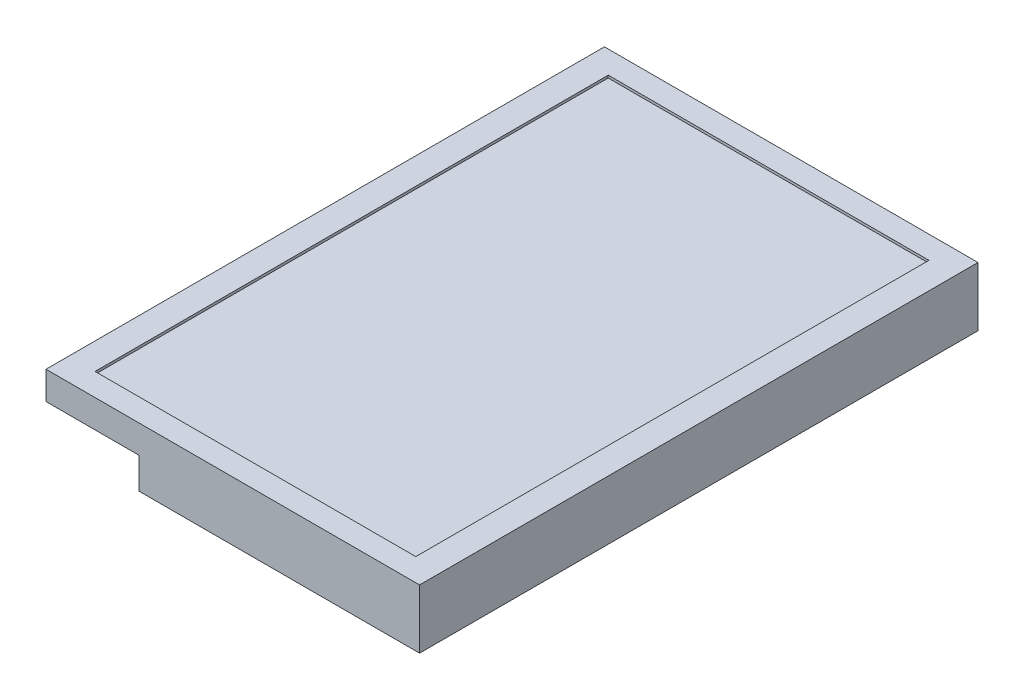
ISO-10303-21;
HEADER;
FILE_DESCRIPTION(('STEP AP214'),'2;1');
FILE_NAME('part.step','',(''),(''),'','','');
FILE_SCHEMA(('AUTOMOTIVE_DESIGN { 1 0 10303 214 1 1 1 1 }'));
ENDSEC;
DATA;
#1=APPLICATION_CONTEXT('core data for automotive mechanical design processes');
#2=APPLICATION_PROTOCOL_DEFINITION('international standard','automotive_design',2000,#1);
#3=PRODUCT_CONTEXT('',#1,'mechanical');
#4=PRODUCT('Part','Part','',(#3));
#5=PRODUCT_RELATED_PRODUCT_CATEGORY('part','',(#4));
#6=PRODUCT_DEFINITION_FORMATION('','',#4);
#7=PRODUCT_DEFINITION_CONTEXT('part definition',#1,'design');
#8=PRODUCT_DEFINITION('design','',#6,#7);
#9=PRODUCT_DEFINITION_SHAPE('','',#8);
#10=(LENGTH_UNIT() NAMED_UNIT(*) SI_UNIT(.MILLI.,.METRE.));
#11=(NAMED_UNIT(*) PLANE_ANGLE_UNIT() SI_UNIT($,.RADIAN.));
#12=(NAMED_UNIT(*) SI_UNIT($,.STERADIAN.) SOLID_ANGLE_UNIT());
#13=UNCERTAINTY_MEASURE_WITH_UNIT(LENGTH_MEASURE(1.E-05),#10,'distance_accuracy_value','');
#14=(GEOMETRIC_REPRESENTATION_CONTEXT(3) GLOBAL_UNCERTAINTY_ASSIGNED_CONTEXT((#13)) GLOBAL_UNIT_ASSIGNED_CONTEXT((#10,
#11,#12)) REPRESENTATION_CONTEXT('',''));
#15=CARTESIAN_POINT('',(0.,0.,0.));
#16=DIRECTION('',(0.,0.,1.));
#17=DIRECTION('',(1.,0.,0.));
#18=AXIS2_PLACEMENT_3D('',#15,#16,#17);
#19=CARTESIAN_POINT('',(-148.5,47.,222.));
#20=DIRECTION('',(1.,0.,0.));
#21=DIRECTION('',(0.,0.,-1.));
#22=AXIS2_PLACEMENT_3D('',#19,#20,#21);
#23=PLANE('',#22);
#24=DIRECTION('',(0.,0.,-1.));
#25=VECTOR('',#24,1.);
#26=CARTESIAN_POINT('',(-148.5,24.7368421052632,222.));
#27=LINE('',#26,#25);
#28=CARTESIAN_POINT('',(-148.5,24.7368421052632,222.));
#29=VERTEX_POINT('',#28);
#30=CARTESIAN_POINT('',(-148.5,24.7368421052632,-222.));
#31=VERTEX_POINT('',#30);
#32=EDGE_CURVE('E109',#29,#31,#27,.T.);
#33=ORIENTED_EDGE('',*,*,#32,.F.);
#34=DIRECTION('',(0.,-1.,0.));
#35=VECTOR('',#34,1.);
#36=CARTESIAN_POINT('',(-148.5,47.,222.));
#37=LINE('',#36,#35);
#38=CARTESIAN_POINT('',(-148.5,47.,222.));
#39=VERTEX_POINT('',#38);
#40=EDGE_CURVE('E130',#39,#29,#37,.T.);
#41=ORIENTED_EDGE('',*,*,#40,.F.);
#42=DIRECTION('',(0.,0.,1.));
#43=VECTOR('',#42,1.);
#44=CARTESIAN_POINT('',(-148.5,47.,222.));
#45=LINE('',#44,#43);
#46=CARTESIAN_POINT('',(-148.5,47.,-222.));
#47=VERTEX_POINT('',#46);
#48=EDGE_CURVE('E129',#47,#39,#45,.T.);
#49=ORIENTED_EDGE('',*,*,#48,.F.);
#50=DIRECTION('',(0.,-1.,0.));
#51=VECTOR('',#50,1.);
#52=CARTESIAN_POINT('',(-148.5,47.,-222.));
#53=LINE('',#52,#51);
#54=EDGE_CURVE('E40',#47,#31,#53,.T.);
#55=ORIENTED_EDGE('',*,*,#54,.T.);
#56=EDGE_LOOP('',(#33,#41,#49,#55));
#57=FACE_BOUND('',#56,.T.);
#58=ADVANCED_FACE('F32',(#57),#23,.F.);
#59=CARTESIAN_POINT('',(148.5,47.,222.));
#60=DIRECTION('',(-1.,0.,0.));
#61=DIRECTION('',(0.,0.,1.));
#62=AXIS2_PLACEMENT_3D('',#59,#60,#61);
#63=PLANE('',#62);
#64=DIRECTION('',(0.,0.,-1.));
#65=VECTOR('',#64,1.);
#66=CARTESIAN_POINT('',(148.5,0.,222.));
#67=LINE('',#66,#65);
#68=CARTESIAN_POINT('',(148.5,0.,222.));
#69=VERTEX_POINT('',#68);
#70=CARTESIAN_POINT('',(148.5,0.,-222.));
#71=VERTEX_POINT('',#70);
#72=EDGE_CURVE('E142',#69,#71,#67,.T.);
#73=ORIENTED_EDGE('',*,*,#72,.T.);
#74=DIRECTION('',(0.,-1.,0.));
#75=VECTOR('',#74,1.);
#76=CARTESIAN_POINT('',(148.5,47.,-222.));
#77=LINE('',#76,#75);
#78=CARTESIAN_POINT('',(148.5,47.,-222.));
#79=VERTEX_POINT('',#78);
#80=EDGE_CURVE('E11',#79,#71,#77,.T.);
#81=ORIENTED_EDGE('',*,*,#80,.F.);
#82=DIRECTION('',(0.,0.,-1.));
#83=VECTOR('',#82,1.);
#84=CARTESIAN_POINT('',(148.5,47.,222.));
#85=LINE('',#84,#83);
#86=CARTESIAN_POINT('',(148.5,47.,222.));
#87=VERTEX_POINT('',#86);
#88=EDGE_CURVE('E139',#87,#79,#85,.T.);
#89=ORIENTED_EDGE('',*,*,#88,.F.);
#90=DIRECTION('',(0.,-1.,0.));
#91=VECTOR('',#90,1.);
#92=CARTESIAN_POINT('',(148.5,47.,222.));
#93=LINE('',#92,#91);
#94=EDGE_CURVE('E131',#87,#69,#93,.T.);
#95=ORIENTED_EDGE('',*,*,#94,.T.);
#96=EDGE_LOOP('',(#73,#81,#89,#95));
#97=FACE_BOUND('',#96,.T.);
#98=ADVANCED_FACE('F34',(#97),#63,.F.);
#99=CARTESIAN_POINT('',(-148.5,47.,-222.));
#100=DIRECTION('',(0.,0.,1.));
#101=DIRECTION('',(1.,0.,0.));
#102=AXIS2_PLACEMENT_3D('',#99,#100,#101);
#103=PLANE('',#102);
#104=DIRECTION('',(-1.,0.,0.));
#105=VECTOR('',#104,1.);
#106=CARTESIAN_POINT('',(-148.5,0.,-222.));
#107=LINE('',#106,#105);
#108=CARTESIAN_POINT('',(-74.4999999999999,0.,-222.));
#109=VERTEX_POINT('',#108);
#110=EDGE_CURVE('E140',#71,#109,#107,.T.);
#111=ORIENTED_EDGE('',*,*,#110,.T.);
#112=DIRECTION('',(0.,-1.,0.));
#113=VECTOR('',#112,1.);
#114=CARTESIAN_POINT('',(-74.4999999999999,24.7368421052632,-222.));
#115=LINE('',#114,#113);
#116=CARTESIAN_POINT('',(-74.4999999999999,24.7368421052632,-222.));
#117=VERTEX_POINT('',#116);
#118=EDGE_CURVE('E47',#117,#109,#115,.T.);
#119=ORIENTED_EDGE('',*,*,#118,.F.);
#120=DIRECTION('',(1.,0.,0.));
#121=VECTOR('',#120,1.);
#122=CARTESIAN_POINT('',(-148.5,24.7368421052632,-222.));
#123=LINE('',#122,#121);
#124=EDGE_CURVE('E113',#31,#117,#123,.T.);
#125=ORIENTED_EDGE('',*,*,#124,.F.);
#126=ORIENTED_EDGE('',*,*,#54,.F.);
#127=DIRECTION('',(-1.,0.,0.));
#128=VECTOR('',#127,1.);
#129=CARTESIAN_POINT('',(-148.5,47.,-222.));
#130=LINE('',#129,#128);
#131=EDGE_CURVE('E148',#79,#47,#130,.T.);
#132=ORIENTED_EDGE('',*,*,#131,.F.);
#133=ORIENTED_EDGE('',*,*,#80,.T.);
#134=EDGE_LOOP('',(#111,#119,#125,#126,#132,#133));
#135=FACE_BOUND('',#134,.T.);
#136=ADVANCED_FACE('F125',(#135),#103,.F.);
#137=CARTESIAN_POINT('',(-148.5,47.,222.));
#138=DIRECTION('',(0.,0.,-1.));
#139=DIRECTION('',(-1.,0.,0.));
#140=AXIS2_PLACEMENT_3D('',#137,#138,#139);
#141=PLANE('',#140);
#142=DIRECTION('',(-1.,0.,0.));
#143=VECTOR('',#142,1.);
#144=CARTESIAN_POINT('',(-148.5,24.7368421052632,222.));
#145=LINE('',#144,#143);
#146=CARTESIAN_POINT('',(-74.5,24.7368421052632,222.));
#147=VERTEX_POINT('',#146);
#148=EDGE_CURVE('E115',#147,#29,#145,.T.);
#149=ORIENTED_EDGE('',*,*,#148,.F.);
#150=DIRECTION('',(0.,-1.,0.));
#151=VECTOR('',#150,1.);
#152=CARTESIAN_POINT('',(-74.5,24.7368421052632,222.));
#153=LINE('',#152,#151);
#154=CARTESIAN_POINT('',(-74.5,0.,222.));
#155=VERTEX_POINT('',#154);
#156=EDGE_CURVE('E171',#147,#155,#153,.T.);
#157=ORIENTED_EDGE('',*,*,#156,.T.);
#158=DIRECTION('',(1.,0.,0.));
#159=VECTOR('',#158,1.);
#160=CARTESIAN_POINT('',(-148.5,0.,222.));
#161=LINE('',#160,#159);
#162=EDGE_CURVE('E137',#155,#69,#161,.T.);
#163=ORIENTED_EDGE('',*,*,#162,.T.);
#164=ORIENTED_EDGE('',*,*,#94,.F.);
#165=DIRECTION('',(1.,0.,0.));
#166=VECTOR('',#165,1.);
#167=CARTESIAN_POINT('',(-148.5,47.,222.));
#168=LINE('',#167,#166);
#169=EDGE_CURVE('E136',#39,#87,#168,.T.);
#170=ORIENTED_EDGE('',*,*,#169,.F.);
#171=ORIENTED_EDGE('',*,*,#40,.T.);
#172=EDGE_LOOP('',(#149,#157,#163,#164,#170,#171));
#173=FACE_BOUND('',#172,.T.);
#174=ADVANCED_FACE('F188',(#173),#141,.F.);
#175=CARTESIAN_POINT('',(148.5,47.,-222.));
#176=DIRECTION('',(0.,-1.,0.));
#177=DIRECTION('',(0.,0.,-1.));
#178=AXIS2_PLACEMENT_3D('',#175,#176,#177);
#179=PLANE('',#178);
#180=DIRECTION('',(-1.,0.,0.));
#181=VECTOR('',#180,1.);
#182=CARTESIAN_POINT('',(-127.5,47.,-204.));
#183=LINE('',#182,#181);
#184=CARTESIAN_POINT('',(127.5,47.,-204.));
#185=VERTEX_POINT('',#184);
#186=CARTESIAN_POINT('',(-127.5,47.,-204.));
#187=VERTEX_POINT('',#186);
#188=EDGE_CURVE('E167',#185,#187,#183,.T.);
#189=ORIENTED_EDGE('',*,*,#188,.F.);
#190=DIRECTION('',(0.,0.,-1.));
#191=VECTOR('',#190,1.);
#192=CARTESIAN_POINT('',(127.5,47.,204.));
#193=LINE('',#192,#191);
#194=CARTESIAN_POINT('',(127.5,47.,204.));
#195=VERTEX_POINT('',#194);
#196=EDGE_CURVE('E55',#195,#185,#193,.T.);
#197=ORIENTED_EDGE('',*,*,#196,.F.);
#198=DIRECTION('',(1.,0.,0.));
#199=VECTOR('',#198,1.);
#200=CARTESIAN_POINT('',(-127.5,47.,204.));
#201=LINE('',#200,#199);
#202=CARTESIAN_POINT('',(-127.5,47.,204.));
#203=VERTEX_POINT('',#202);
#204=EDGE_CURVE('E160',#203,#195,#201,.T.);
#205=ORIENTED_EDGE('',*,*,#204,.F.);
#206=DIRECTION('',(0.,0.,1.));
#207=VECTOR('',#206,1.);
#208=CARTESIAN_POINT('',(-127.5,47.,204.));
#209=LINE('',#208,#207);
#210=EDGE_CURVE('E164',#187,#203,#209,.T.);
#211=ORIENTED_EDGE('',*,*,#210,.F.);
#212=EDGE_LOOP('',(#189,#197,#205,#211));
#213=FACE_BOUND('',#212,.T.);
#214=ORIENTED_EDGE('',*,*,#88,.T.);
#215=ORIENTED_EDGE('',*,*,#131,.T.);
#216=ORIENTED_EDGE('',*,*,#48,.T.);
#217=ORIENTED_EDGE('',*,*,#169,.T.);
#218=EDGE_LOOP('',(#214,#215,#216,#217));
#219=FACE_BOUND('',#218,.T.);
#220=ADVANCED_FACE('F194',(#213,#219),#179,.F.);
#221=CARTESIAN_POINT('',(148.5,0.,-222.));
#222=DIRECTION('',(0.,-1.,0.));
#223=DIRECTION('',(0.,0.,-1.));
#224=AXIS2_PLACEMENT_3D('',#221,#222,#223);
#225=PLANE('',#224);
#226=DIRECTION('',(0.,0.,1.));
#227=VECTOR('',#226,1.);
#228=CARTESIAN_POINT('',(-74.5,0.,222.));
#229=LINE('',#228,#227);
#230=EDGE_CURVE('E120',#109,#155,#229,.T.);
#231=ORIENTED_EDGE('',*,*,#230,.F.);
#232=ORIENTED_EDGE('',*,*,#110,.F.);
#233=ORIENTED_EDGE('',*,*,#72,.F.);
#234=ORIENTED_EDGE('',*,*,#162,.F.);
#235=EDGE_LOOP('',(#231,#232,#233,#234));
#236=FACE_BOUND('',#235,.T.);
#237=ADVANCED_FACE('F199',(#236),#225,.T.);
#238=CARTESIAN_POINT('',(127.5,45.,204.));
#239=DIRECTION('',(1.,0.,0.));
#240=DIRECTION('',(0.,0.,-1.));
#241=AXIS2_PLACEMENT_3D('',#238,#239,#240);
#242=PLANE('',#241);
#243=ORIENTED_EDGE('',*,*,#196,.T.);
#244=DIRECTION('',(0.,1.,0.));
#245=VECTOR('',#244,1.);
#246=CARTESIAN_POINT('',(127.5,45.,-204.));
#247=LINE('',#246,#245);
#248=CARTESIAN_POINT('',(127.5,45.,-204.));
#249=VERTEX_POINT('',#248);
#250=EDGE_CURVE('E152',#249,#185,#247,.T.);
#251=ORIENTED_EDGE('',*,*,#250,.F.);
#252=DIRECTION('',(0.,0.,-1.));
#253=VECTOR('',#252,1.);
#254=CARTESIAN_POINT('',(127.5,45.,204.));
#255=LINE('',#254,#253);
#256=CARTESIAN_POINT('',(127.5,45.,204.));
#257=VERTEX_POINT('',#256);
#258=EDGE_CURVE('E163',#257,#249,#255,.T.);
#259=ORIENTED_EDGE('',*,*,#258,.F.);
#260=DIRECTION('',(0.,1.,0.));
#261=VECTOR('',#260,1.);
#262=CARTESIAN_POINT('',(127.5,45.,204.));
#263=LINE('',#262,#261);
#264=EDGE_CURVE('E145',#257,#195,#263,.T.);
#265=ORIENTED_EDGE('',*,*,#264,.T.);
#266=EDGE_LOOP('',(#243,#251,#259,#265));
#267=FACE_BOUND('',#266,.T.);
#268=ADVANCED_FACE('F231',(#267),#242,.F.);
#269=CARTESIAN_POINT('',(-127.5,45.,204.));
#270=DIRECTION('',(0.,0.,1.));
#271=DIRECTION('',(1.,0.,0.));
#272=AXIS2_PLACEMENT_3D('',#269,#270,#271);
#273=PLANE('',#272);
#274=ORIENTED_EDGE('',*,*,#204,.T.);
#275=ORIENTED_EDGE('',*,*,#264,.F.);
#276=DIRECTION('',(1.,0.,0.));
#277=VECTOR('',#276,1.);
#278=CARTESIAN_POINT('',(-127.5,45.,204.));
#279=LINE('',#278,#277);
#280=CARTESIAN_POINT('',(-127.5,45.,204.));
#281=VERTEX_POINT('',#280);
#282=EDGE_CURVE('E155',#281,#257,#279,.T.);
#283=ORIENTED_EDGE('',*,*,#282,.F.);
#284=DIRECTION('',(0.,1.,0.));
#285=VECTOR('',#284,1.);
#286=CARTESIAN_POINT('',(-127.5,45.,204.));
#287=LINE('',#286,#285);
#288=EDGE_CURVE('E157',#281,#203,#287,.T.);
#289=ORIENTED_EDGE('',*,*,#288,.T.);
#290=EDGE_LOOP('',(#274,#275,#283,#289));
#291=FACE_BOUND('',#290,.T.);
#292=ADVANCED_FACE('F236',(#291),#273,.F.);
#293=CARTESIAN_POINT('',(-127.5,45.,204.));
#294=DIRECTION('',(-1.,0.,0.));
#295=DIRECTION('',(0.,0.,1.));
#296=AXIS2_PLACEMENT_3D('',#293,#294,#295);
#297=PLANE('',#296);
#298=ORIENTED_EDGE('',*,*,#210,.T.);
#299=ORIENTED_EDGE('',*,*,#288,.F.);
#300=DIRECTION('',(0.,0.,1.));
#301=VECTOR('',#300,1.);
#302=CARTESIAN_POINT('',(-127.5,45.,204.));
#303=LINE('',#302,#301);
#304=CARTESIAN_POINT('',(-127.5,45.,-204.));
#305=VERTEX_POINT('',#304);
#306=EDGE_CURVE('E174',#305,#281,#303,.T.);
#307=ORIENTED_EDGE('',*,*,#306,.F.);
#308=DIRECTION('',(0.,1.,0.));
#309=VECTOR('',#308,1.);
#310=CARTESIAN_POINT('',(-127.5,45.,-204.));
#311=LINE('',#310,#309);
#312=EDGE_CURVE('E154',#305,#187,#311,.T.);
#313=ORIENTED_EDGE('',*,*,#312,.T.);
#314=EDGE_LOOP('',(#298,#299,#307,#313));
#315=FACE_BOUND('',#314,.T.);
#316=ADVANCED_FACE('F239',(#315),#297,.F.);
#317=CARTESIAN_POINT('',(-127.5,45.,-204.));
#318=DIRECTION('',(0.,0.,-1.));
#319=DIRECTION('',(-1.,0.,0.));
#320=AXIS2_PLACEMENT_3D('',#317,#318,#319);
#321=PLANE('',#320);
#322=ORIENTED_EDGE('',*,*,#188,.T.);
#323=ORIENTED_EDGE('',*,*,#312,.F.);
#324=DIRECTION('',(-1.,0.,0.));
#325=VECTOR('',#324,1.);
#326=CARTESIAN_POINT('',(-127.5,45.,-204.));
#327=LINE('',#326,#325);
#328=EDGE_CURVE('E177',#249,#305,#327,.T.);
#329=ORIENTED_EDGE('',*,*,#328,.F.);
#330=ORIENTED_EDGE('',*,*,#250,.T.);
#331=EDGE_LOOP('',(#322,#323,#329,#330));
#332=FACE_BOUND('',#331,.T.);
#333=ADVANCED_FACE('F209',(#332),#321,.F.);
#334=CARTESIAN_POINT('',(127.5,45.,-204.));
#335=DIRECTION('',(0.,-1.,0.));
#336=DIRECTION('',(0.,0.,-1.));
#337=AXIS2_PLACEMENT_3D('',#334,#335,#336);
#338=PLANE('',#337);
#339=ORIENTED_EDGE('',*,*,#258,.T.);
#340=ORIENTED_EDGE('',*,*,#328,.T.);
#341=ORIENTED_EDGE('',*,*,#306,.T.);
#342=ORIENTED_EDGE('',*,*,#282,.T.);
#343=EDGE_LOOP('',(#339,#340,#341,#342));
#344=FACE_BOUND('',#343,.T.);
#345=ADVANCED_FACE('F202',(#344),#338,.F.);
#346=CARTESIAN_POINT('',(-74.5,24.7368421052632,222.));
#347=DIRECTION('',(1.,0.,0.));
#348=DIRECTION('',(0.,0.,-1.));
#349=AXIS2_PLACEMENT_3D('',#346,#347,#348);
#350=PLANE('',#349);
#351=ORIENTED_EDGE('',*,*,#230,.T.);
#352=ORIENTED_EDGE('',*,*,#156,.F.);
#353=DIRECTION('',(0.,0.,1.));
#354=VECTOR('',#353,1.);
#355=CARTESIAN_POINT('',(-74.5,24.7368421052632,222.));
#356=LINE('',#355,#354);
#357=EDGE_CURVE('E127',#117,#147,#356,.T.);
#358=ORIENTED_EDGE('',*,*,#357,.F.);
#359=ORIENTED_EDGE('',*,*,#118,.T.);
#360=EDGE_LOOP('',(#351,#352,#358,#359));
#361=FACE_BOUND('',#360,.T.);
#362=ADVANCED_FACE('F200',(#361),#350,.F.);
#363=CARTESIAN_POINT('',(-148.5,24.7368421052632,-222.));
#364=DIRECTION('',(0.,-1.,0.));
#365=DIRECTION('',(0.,0.,-1.));
#366=AXIS2_PLACEMENT_3D('',#363,#364,#365);
#367=PLANE('',#366);
#368=ORIENTED_EDGE('',*,*,#32,.T.);
#369=ORIENTED_EDGE('',*,*,#124,.T.);
#370=ORIENTED_EDGE('',*,*,#357,.T.);
#371=ORIENTED_EDGE('',*,*,#148,.T.);
#372=EDGE_LOOP('',(#368,#369,#370,#371));
#373=FACE_BOUND('',#372,.T.);
#374=ADVANCED_FACE('F111',(#373),#367,.T.);
#375=CLOSED_SHELL('',(#58,#98,#136,#174,#220,#237,#268,#292,#316,#333,#345,#362,#374));
#376=MANIFOLD_SOLID_BREP('B2',#375);
#377=ADVANCED_BREP_SHAPE_REPRESENTATION('',(#18,#376),#14);
#378=SHAPE_DEFINITION_REPRESENTATION(#9,#377);
ENDSEC;
END-ISO-10303-21;
